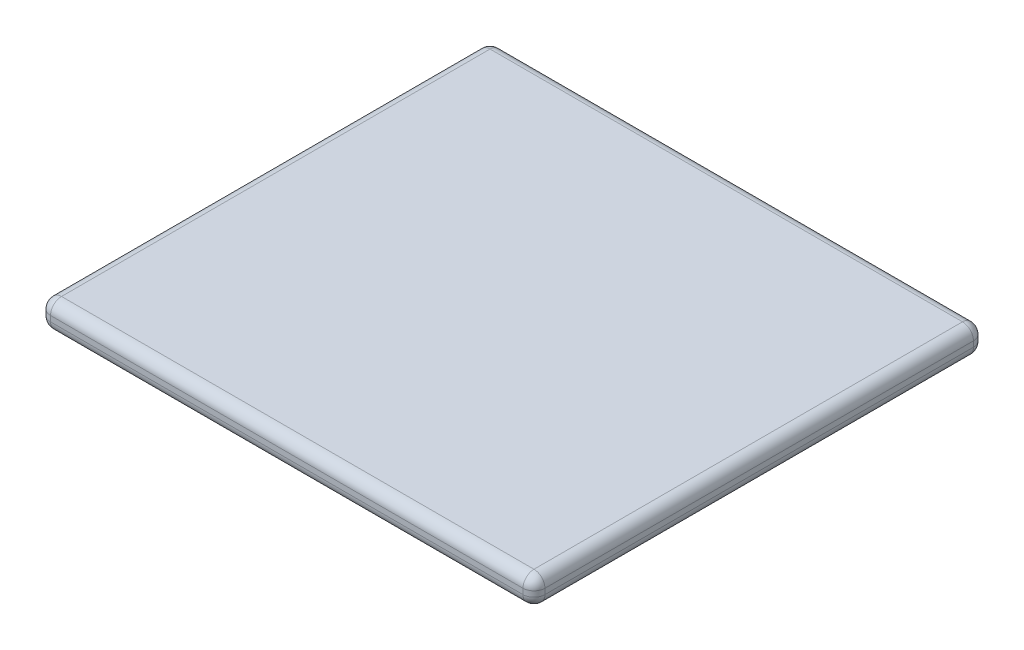
ISO-10303-21;
HEADER;
FILE_DESCRIPTION(('STEP AP214'),'2;1');
FILE_NAME('part.step','',(''),(''),'','','');
FILE_SCHEMA(('AUTOMOTIVE_DESIGN { 1 0 10303 214 1 1 1 1 }'));
ENDSEC;
DATA;
#1=APPLICATION_CONTEXT('core data for automotive mechanical design processes');
#2=APPLICATION_PROTOCOL_DEFINITION('international standard','automotive_design',2000,#1);
#3=PRODUCT_CONTEXT('',#1,'mechanical');
#4=PRODUCT('Part','Part','',(#3));
#5=PRODUCT_RELATED_PRODUCT_CATEGORY('part','',(#4));
#6=PRODUCT_DEFINITION_FORMATION('','',#4);
#7=PRODUCT_DEFINITION_CONTEXT('part definition',#1,'design');
#8=PRODUCT_DEFINITION('design','',#6,#7);
#9=PRODUCT_DEFINITION_SHAPE('','',#8);
#10=(LENGTH_UNIT() NAMED_UNIT(*) SI_UNIT(.MILLI.,.METRE.));
#11=(NAMED_UNIT(*) PLANE_ANGLE_UNIT() SI_UNIT($,.RADIAN.));
#12=(NAMED_UNIT(*) SI_UNIT($,.STERADIAN.) SOLID_ANGLE_UNIT());
#13=UNCERTAINTY_MEASURE_WITH_UNIT(LENGTH_MEASURE(1.E-05),#10,'distance_accuracy_value','');
#14=(GEOMETRIC_REPRESENTATION_CONTEXT(3) GLOBAL_UNCERTAINTY_ASSIGNED_CONTEXT((#13)) GLOBAL_UNIT_ASSIGNED_CONTEXT((#10,
#11,#12)) REPRESENTATION_CONTEXT('',''));
#15=CARTESIAN_POINT('',(0.,0.,0.));
#16=DIRECTION('',(0.,0.,1.));
#17=DIRECTION('',(1.,0.,0.));
#18=AXIS2_PLACEMENT_3D('',#15,#16,#17);
#19=CARTESIAN_POINT('',(245.,25.,205.));
#20=DIRECTION('',(-1.,0.,0.));
#21=DIRECTION('',(0.,0.,1.));
#22=AXIS2_PLACEMENT_3D('',#19,#20,#21);
#23=PLANE('',#22);
#24=DIRECTION('',(0.,-1.,0.));
#25=VECTOR('',#24,1.);
#26=CARTESIAN_POINT('',(245.,25.,-195.));
#27=LINE('',#26,#25);
#28=CARTESIAN_POINT('',(245.,10.,-195.));
#29=VERTEX_POINT('',#28);
#30=CARTESIAN_POINT('',(245.,15.,-195.));
#31=VERTEX_POINT('',#30);
#32=EDGE_CURVE('E142',#29,#31,#27,.F.);
#33=ORIENTED_EDGE('',*,*,#32,.T.);
#34=DIRECTION('',(0.,0.,-1.));
#35=VECTOR('',#34,1.);
#36=CARTESIAN_POINT('',(245.,15.,205.));
#37=LINE('',#36,#35);
#38=CARTESIAN_POINT('',(245.,15.,195.));
#39=VERTEX_POINT('',#38);
#40=EDGE_CURVE('E188',#31,#39,#37,.F.);
#41=ORIENTED_EDGE('',*,*,#40,.T.);
#42=DIRECTION('',(0.,-1.,0.));
#43=VECTOR('',#42,1.);
#44=CARTESIAN_POINT('',(245.,25.,195.));
#45=LINE('',#44,#43);
#46=CARTESIAN_POINT('',(245.,10.,195.));
#47=VERTEX_POINT('',#46);
#48=EDGE_CURVE('E183',#39,#47,#45,.T.);
#49=ORIENTED_EDGE('',*,*,#48,.T.);
#50=DIRECTION('',(0.,0.,-1.));
#51=VECTOR('',#50,1.);
#52=CARTESIAN_POINT('',(245.,10.,-205.));
#53=LINE('',#52,#51);
#54=EDGE_CURVE('E177',#47,#29,#53,.T.);
#55=ORIENTED_EDGE('',*,*,#54,.T.);
#56=EDGE_LOOP('',(#33,#41,#49,#55));
#57=FACE_BOUND('',#56,.T.);
#58=ADVANCED_FACE('F45',(#57),#23,.F.);
#59=CARTESIAN_POINT('',(-205.,25.,-205.));
#60=DIRECTION('',(0.,0.,1.));
#61=DIRECTION('',(1.,0.,0.));
#62=AXIS2_PLACEMENT_3D('',#59,#60,#61);
#63=PLANE('',#62);
#64=DIRECTION('',(0.,-1.,0.));
#65=VECTOR('',#64,1.);
#66=CARTESIAN_POINT('',(-195.,25.,-205.));
#67=LINE('',#66,#65);
#68=CARTESIAN_POINT('',(-195.,10.,-205.));
#69=VERTEX_POINT('',#68);
#70=CARTESIAN_POINT('',(-195.,15.,-205.));
#71=VERTEX_POINT('',#70);
#72=EDGE_CURVE('E167',#69,#71,#67,.F.);
#73=ORIENTED_EDGE('',*,*,#72,.T.);
#74=DIRECTION('',(-1.,0.,0.));
#75=VECTOR('',#74,1.);
#76=CARTESIAN_POINT('',(-205.,15.,-205.));
#77=LINE('',#76,#75);
#78=CARTESIAN_POINT('',(235.,15.,-205.));
#79=VERTEX_POINT('',#78);
#80=EDGE_CURVE('E171',#71,#79,#77,.F.);
#81=ORIENTED_EDGE('',*,*,#80,.T.);
#82=DIRECTION('',(0.,-1.,0.));
#83=VECTOR('',#82,1.);
#84=CARTESIAN_POINT('',(235.,25.,-205.));
#85=LINE('',#84,#83);
#86=CARTESIAN_POINT('',(235.,10.,-205.));
#87=VERTEX_POINT('',#86);
#88=EDGE_CURVE('E140',#79,#87,#85,.T.);
#89=ORIENTED_EDGE('',*,*,#88,.T.);
#90=DIRECTION('',(-1.,0.,0.));
#91=VECTOR('',#90,1.);
#92=CARTESIAN_POINT('',(-205.,10.,-205.));
#93=LINE('',#92,#91);
#94=EDGE_CURVE('E160',#87,#69,#93,.T.);
#95=ORIENTED_EDGE('',*,*,#94,.T.);
#96=EDGE_LOOP('',(#73,#81,#89,#95));
#97=FACE_BOUND('',#96,.T.);
#98=ADVANCED_FACE('F169',(#97),#63,.F.);
#99=CARTESIAN_POINT('',(-205.,25.,-205.));
#100=DIRECTION('',(1.,0.,0.));
#101=DIRECTION('',(0.,0.,-1.));
#102=AXIS2_PLACEMENT_3D('',#99,#100,#101);
#103=PLANE('',#102);
#104=DIRECTION('',(0.,-1.,0.));
#105=VECTOR('',#104,1.);
#106=CARTESIAN_POINT('',(-205.,25.,195.));
#107=LINE('',#106,#105);
#108=CARTESIAN_POINT('',(-205.,10.,195.));
#109=VERTEX_POINT('',#108);
#110=CARTESIAN_POINT('',(-205.,15.,195.));
#111=VERTEX_POINT('',#110);
#112=EDGE_CURVE('E194',#109,#111,#107,.F.);
#113=ORIENTED_EDGE('',*,*,#112,.T.);
#114=DIRECTION('',(0.,0.,1.));
#115=VECTOR('',#114,1.);
#116=CARTESIAN_POINT('',(-205.,15.,-205.));
#117=LINE('',#116,#115);
#118=CARTESIAN_POINT('',(-205.,15.,-195.));
#119=VERTEX_POINT('',#118);
#120=EDGE_CURVE('E201',#111,#119,#117,.F.);
#121=ORIENTED_EDGE('',*,*,#120,.T.);
#122=DIRECTION('',(0.,-1.,0.));
#123=VECTOR('',#122,1.);
#124=CARTESIAN_POINT('',(-205.,25.,-195.));
#125=LINE('',#124,#123);
#126=CARTESIAN_POINT('',(-205.,10.,-195.));
#127=VERTEX_POINT('',#126);
#128=EDGE_CURVE('E197',#119,#127,#125,.T.);
#129=ORIENTED_EDGE('',*,*,#128,.T.);
#130=DIRECTION('',(0.,0.,1.));
#131=VECTOR('',#130,1.);
#132=CARTESIAN_POINT('',(-205.,10.,205.));
#133=LINE('',#132,#131);
#134=EDGE_CURVE('E191',#127,#109,#133,.T.);
#135=ORIENTED_EDGE('',*,*,#134,.T.);
#136=EDGE_LOOP('',(#113,#121,#129,#135));
#137=FACE_BOUND('',#136,.T.);
#138=ADVANCED_FACE('F340',(#137),#103,.F.);
#139=CARTESIAN_POINT('',(-205.,25.,205.));
#140=DIRECTION('',(0.,0.,-1.));
#141=DIRECTION('',(-1.,0.,0.));
#142=AXIS2_PLACEMENT_3D('',#139,#140,#141);
#143=PLANE('',#142);
#144=DIRECTION('',(0.,-1.,0.));
#145=VECTOR('',#144,1.);
#146=CARTESIAN_POINT('',(235.,25.,205.));
#147=LINE('',#146,#145);
#148=CARTESIAN_POINT('',(235.,10.,205.));
#149=VERTEX_POINT('',#148);
#150=CARTESIAN_POINT('',(235.,15.,205.));
#151=VERTEX_POINT('',#150);
#152=EDGE_CURVE('E207',#149,#151,#147,.F.);
#153=ORIENTED_EDGE('',*,*,#152,.T.);
#154=DIRECTION('',(1.,0.,0.));
#155=VECTOR('',#154,1.);
#156=CARTESIAN_POINT('',(-205.,15.,205.));
#157=LINE('',#156,#155);
#158=CARTESIAN_POINT('',(-195.,15.,205.));
#159=VERTEX_POINT('',#158);
#160=EDGE_CURVE('E214',#151,#159,#157,.F.);
#161=ORIENTED_EDGE('',*,*,#160,.T.);
#162=DIRECTION('',(0.,-1.,0.));
#163=VECTOR('',#162,1.);
#164=CARTESIAN_POINT('',(-195.,25.,205.));
#165=LINE('',#164,#163);
#166=CARTESIAN_POINT('',(-195.,10.,205.));
#167=VERTEX_POINT('',#166);
#168=EDGE_CURVE('E210',#159,#167,#165,.T.);
#169=ORIENTED_EDGE('',*,*,#168,.T.);
#170=DIRECTION('',(1.,0.,0.));
#171=VECTOR('',#170,1.);
#172=CARTESIAN_POINT('',(245.,10.,205.));
#173=LINE('',#172,#171);
#174=EDGE_CURVE('E204',#167,#149,#173,.T.);
#175=ORIENTED_EDGE('',*,*,#174,.T.);
#176=EDGE_LOOP('',(#153,#161,#169,#175));
#177=FACE_BOUND('',#176,.T.);
#178=ADVANCED_FACE('F351',(#177),#143,.F.);
#179=CARTESIAN_POINT('',(0.,25.,0.));
#180=DIRECTION('',(0.,-1.,0.));
#181=DIRECTION('',(0.,0.,-1.));
#182=AXIS2_PLACEMENT_3D('',#179,#180,#181);
#183=PLANE('',#182);
#184=DIRECTION('',(0.,0.,1.));
#185=VECTOR('',#184,1.);
#186=CARTESIAN_POINT('',(-195.,25.,0.));
#187=LINE('',#186,#185);
#188=CARTESIAN_POINT('',(-195.,25.,-195.));
#189=VERTEX_POINT('',#188);
#190=CARTESIAN_POINT('',(-195.,25.,195.));
#191=VERTEX_POINT('',#190);
#192=EDGE_CURVE('E223',#189,#191,#187,.T.);
#193=ORIENTED_EDGE('',*,*,#192,.T.);
#194=DIRECTION('',(1.,0.,0.));
#195=VECTOR('',#194,1.);
#196=CARTESIAN_POINT('',(0.,25.,195.));
#197=LINE('',#196,#195);
#198=CARTESIAN_POINT('',(235.,25.,195.));
#199=VERTEX_POINT('',#198);
#200=EDGE_CURVE('E226',#191,#199,#197,.T.);
#201=ORIENTED_EDGE('',*,*,#200,.T.);
#202=DIRECTION('',(0.,0.,-1.));
#203=VECTOR('',#202,1.);
#204=CARTESIAN_POINT('',(235.,25.,0.));
#205=LINE('',#204,#203);
#206=CARTESIAN_POINT('',(235.,25.,-195.));
#207=VERTEX_POINT('',#206);
#208=EDGE_CURVE('E217',#199,#207,#205,.T.);
#209=ORIENTED_EDGE('',*,*,#208,.T.);
#210=DIRECTION('',(-1.,0.,0.));
#211=VECTOR('',#210,1.);
#212=CARTESIAN_POINT('',(0.,25.,-195.));
#213=LINE('',#212,#211);
#214=EDGE_CURVE('E220',#207,#189,#213,.T.);
#215=ORIENTED_EDGE('',*,*,#214,.T.);
#216=EDGE_LOOP('',(#193,#201,#209,#215));
#217=FACE_BOUND('',#216,.T.);
#218=ADVANCED_FACE('F332',(#217),#183,.F.);
#219=CARTESIAN_POINT('',(0.,0.,0.));
#220=DIRECTION('',(0.,-1.,0.));
#221=DIRECTION('',(0.,0.,-1.));
#222=AXIS2_PLACEMENT_3D('',#219,#220,#221);
#223=PLANE('',#222);
#224=DIRECTION('',(0.,0.,1.));
#225=VECTOR('',#224,1.);
#226=CARTESIAN_POINT('',(-195.,0.,-205.));
#227=LINE('',#226,#225);
#228=CARTESIAN_POINT('',(-195.,0.,195.));
#229=VERTEX_POINT('',#228);
#230=CARTESIAN_POINT('',(-195.,0.,-195.));
#231=VERTEX_POINT('',#230);
#232=EDGE_CURVE('E55',#229,#231,#227,.F.);
#233=ORIENTED_EDGE('',*,*,#232,.T.);
#234=DIRECTION('',(-1.,0.,0.));
#235=VECTOR('',#234,1.);
#236=CARTESIAN_POINT('',(245.,0.,-195.));
#237=LINE('',#236,#235);
#238=CARTESIAN_POINT('',(235.,0.,-195.));
#239=VERTEX_POINT('',#238);
#240=EDGE_CURVE('E11',#231,#239,#237,.F.);
#241=ORIENTED_EDGE('',*,*,#240,.T.);
#242=DIRECTION('',(0.,0.,-1.));
#243=VECTOR('',#242,1.);
#244=CARTESIAN_POINT('',(235.,0.,205.));
#245=LINE('',#244,#243);
#246=CARTESIAN_POINT('',(235.,0.,195.));
#247=VERTEX_POINT('',#246);
#248=EDGE_CURVE('E230',#239,#247,#245,.F.);
#249=ORIENTED_EDGE('',*,*,#248,.T.);
#250=DIRECTION('',(1.,0.,0.));
#251=VECTOR('',#250,1.);
#252=CARTESIAN_POINT('',(-205.,0.,195.));
#253=LINE('',#252,#251);
#254=EDGE_CURVE('E66',#247,#229,#253,.F.);
#255=ORIENTED_EDGE('',*,*,#254,.T.);
#256=EDGE_LOOP('',(#233,#241,#249,#255));
#257=FACE_BOUND('',#256,.T.);
#258=ADVANCED_FACE('F577',(#257),#223,.T.);
#259=CARTESIAN_POINT('',(-195.,25.,195.));
#260=DIRECTION('',(0.,-1.,0.));
#261=DIRECTION('',(0.,0.,-1.));
#262=AXIS2_PLACEMENT_3D('',#259,#260,#261);
#263=CYLINDRICAL_SURFACE('',#262,10.);
#264=CARTESIAN_POINT('',(-195.,15.,195.));
#265=DIRECTION('',(0.,1.,0.));
#266=DIRECTION('',(0.,0.,1.));
#267=AXIS2_PLACEMENT_3D('',#264,#265,#266);
#268=CIRCLE('',#267,10.);
#269=EDGE_CURVE('E49',#111,#159,#268,.T.);
#270=ORIENTED_EDGE('',*,*,#269,.F.);
#271=ORIENTED_EDGE('',*,*,#112,.F.);
#272=CARTESIAN_POINT('',(-195.,10.,195.));
#273=DIRECTION('',(0.,-1.,0.));
#274=DIRECTION('',(0.,0.,-1.));
#275=AXIS2_PLACEMENT_3D('',#272,#273,#274);
#276=CIRCLE('',#275,10.);
#277=EDGE_CURVE('E307',#167,#109,#276,.T.);
#278=ORIENTED_EDGE('',*,*,#277,.F.);
#279=ORIENTED_EDGE('',*,*,#168,.F.);
#280=EDGE_LOOP('',(#270,#271,#278,#279));
#281=FACE_BOUND('',#280,.T.);
#282=ADVANCED_FACE('F47',(#281),#263,.T.);
#283=CARTESIAN_POINT('',(-195.,15.,195.));
#284=DIRECTION('',(0.,0.,1.));
#285=DIRECTION('',(1.,0.,0.));
#286=AXIS2_PLACEMENT_3D('',#283,#284,#285);
#287=SPHERICAL_SURFACE('',#286,10.);
#288=CARTESIAN_POINT('',(-195.,15.,195.));
#289=DIRECTION('',(0.,0.,1.));
#290=DIRECTION('',(1.,0.,0.));
#291=AXIS2_PLACEMENT_3D('',#288,#289,#290);
#292=CIRCLE('',#291,10.);
#293=EDGE_CURVE('E300',#111,#191,#292,.F.);
#294=ORIENTED_EDGE('',*,*,#293,.F.);
#295=ORIENTED_EDGE('',*,*,#269,.T.);
#296=CARTESIAN_POINT('',(-195.,15.,195.));
#297=DIRECTION('',(-1.,0.,0.));
#298=DIRECTION('',(0.,0.,1.));
#299=AXIS2_PLACEMENT_3D('',#296,#297,#298);
#300=CIRCLE('',#299,10.);
#301=EDGE_CURVE('E304',#191,#159,#300,.F.);
#302=ORIENTED_EDGE('',*,*,#301,.F.);
#303=EDGE_LOOP('',(#294,#295,#302));
#304=FACE_BOUND('',#303,.T.);
#305=ADVANCED_FACE('F320',(#304),#287,.T.);
#306=CARTESIAN_POINT('',(-195.,10.,195.));
#307=DIRECTION('',(-1.,0.,0.));
#308=DIRECTION('',(0.,0.,1.));
#309=AXIS2_PLACEMENT_3D('',#306,#307,#308);
#310=SPHERICAL_SURFACE('',#309,10.);
#311=CARTESIAN_POINT('',(-195.,10.,195.));
#312=DIRECTION('',(-1.,0.,0.));
#313=DIRECTION('',(0.,0.,1.));
#314=AXIS2_PLACEMENT_3D('',#311,#312,#313);
#315=CIRCLE('',#314,10.);
#316=EDGE_CURVE('E293',#167,#229,#315,.F.);
#317=ORIENTED_EDGE('',*,*,#316,.F.);
#318=ORIENTED_EDGE('',*,*,#277,.T.);
#319=CARTESIAN_POINT('',(-195.,10.,195.));
#320=DIRECTION('',(0.,0.,1.));
#321=DIRECTION('',(1.,0.,0.));
#322=AXIS2_PLACEMENT_3D('',#319,#320,#321);
#323=CIRCLE('',#322,10.);
#324=EDGE_CURVE('E296',#229,#109,#323,.F.);
#325=ORIENTED_EDGE('',*,*,#324,.F.);
#326=EDGE_LOOP('',(#317,#318,#325));
#327=FACE_BOUND('',#326,.T.);
#328=ADVANCED_FACE('F550',(#327),#310,.T.);
#329=CARTESIAN_POINT('',(0.,15.,195.));
#330=DIRECTION('',(1.,0.,0.));
#331=DIRECTION('',(0.,0.,-1.));
#332=AXIS2_PLACEMENT_3D('',#329,#330,#331);
#333=CYLINDRICAL_SURFACE('',#332,10.);
#334=ORIENTED_EDGE('',*,*,#301,.T.);
#335=ORIENTED_EDGE('',*,*,#160,.F.);
#336=CARTESIAN_POINT('',(235.,15.,195.));
#337=DIRECTION('',(1.,0.,0.));
#338=DIRECTION('',(0.,0.,-1.));
#339=AXIS2_PLACEMENT_3D('',#336,#337,#338);
#340=CIRCLE('',#339,10.);
#341=EDGE_CURVE('E285',#199,#151,#340,.T.);
#342=ORIENTED_EDGE('',*,*,#341,.F.);
#343=ORIENTED_EDGE('',*,*,#200,.F.);
#344=EDGE_LOOP('',(#334,#335,#342,#343));
#345=FACE_BOUND('',#344,.T.);
#346=ADVANCED_FACE('F328',(#345),#333,.T.);
#347=CARTESIAN_POINT('',(-195.,15.,0.));
#348=DIRECTION('',(0.,0.,1.));
#349=DIRECTION('',(1.,0.,0.));
#350=AXIS2_PLACEMENT_3D('',#347,#348,#349);
#351=CYLINDRICAL_SURFACE('',#350,10.);
#352=ORIENTED_EDGE('',*,*,#293,.T.);
#353=ORIENTED_EDGE('',*,*,#192,.F.);
#354=CARTESIAN_POINT('',(-195.,15.,-195.));
#355=DIRECTION('',(0.,0.,-1.));
#356=DIRECTION('',(-1.,0.,0.));
#357=AXIS2_PLACEMENT_3D('',#354,#355,#356);
#358=CIRCLE('',#357,10.);
#359=EDGE_CURVE('E281',#119,#189,#358,.T.);
#360=ORIENTED_EDGE('',*,*,#359,.F.);
#361=ORIENTED_EDGE('',*,*,#120,.F.);
#362=EDGE_LOOP('',(#352,#353,#360,#361));
#363=FACE_BOUND('',#362,.T.);
#364=ADVANCED_FACE('F337',(#363),#351,.T.);
#365=CARTESIAN_POINT('',(-195.,25.,-195.));
#366=DIRECTION('',(0.,-1.,0.));
#367=DIRECTION('',(0.,0.,-1.));
#368=AXIS2_PLACEMENT_3D('',#365,#366,#367);
#369=CYLINDRICAL_SURFACE('',#368,10.);
#370=CARTESIAN_POINT('',(-195.,10.,-195.));
#371=DIRECTION('',(0.,-1.,0.));
#372=DIRECTION('',(0.,0.,-1.));
#373=AXIS2_PLACEMENT_3D('',#370,#371,#372);
#374=CIRCLE('',#373,10.);
#375=EDGE_CURVE('E273',#127,#69,#374,.T.);
#376=ORIENTED_EDGE('',*,*,#375,.F.);
#377=ORIENTED_EDGE('',*,*,#128,.F.);
#378=CARTESIAN_POINT('',(-195.,15.,-195.));
#379=DIRECTION('',(0.,1.,0.));
#380=DIRECTION('',(0.,0.,1.));
#381=AXIS2_PLACEMENT_3D('',#378,#379,#380);
#382=CIRCLE('',#381,10.);
#383=EDGE_CURVE('E277',#71,#119,#382,.T.);
#384=ORIENTED_EDGE('',*,*,#383,.F.);
#385=ORIENTED_EDGE('',*,*,#72,.F.);
#386=EDGE_LOOP('',(#376,#377,#384,#385));
#387=FACE_BOUND('',#386,.T.);
#388=ADVANCED_FACE('F344',(#387),#369,.T.);
#389=CARTESIAN_POINT('',(-195.,10.,-205.));
#390=DIRECTION('',(0.,0.,-1.));
#391=DIRECTION('',(-1.,0.,0.));
#392=AXIS2_PLACEMENT_3D('',#389,#390,#391);
#393=CYLINDRICAL_SURFACE('',#392,10.);
#394=ORIENTED_EDGE('',*,*,#324,.T.);
#395=ORIENTED_EDGE('',*,*,#134,.F.);
#396=CARTESIAN_POINT('',(-195.,10.,-195.));
#397=DIRECTION('',(0.,0.,-1.));
#398=DIRECTION('',(-1.,0.,0.));
#399=AXIS2_PLACEMENT_3D('',#396,#397,#398);
#400=CIRCLE('',#399,10.);
#401=EDGE_CURVE('E270',#231,#127,#400,.T.);
#402=ORIENTED_EDGE('',*,*,#401,.F.);
#403=ORIENTED_EDGE('',*,*,#232,.F.);
#404=EDGE_LOOP('',(#394,#395,#402,#403));
#405=FACE_BOUND('',#404,.T.);
#406=ADVANCED_FACE('F349',(#405),#393,.T.);
#407=CARTESIAN_POINT('',(-205.,10.,195.));
#408=DIRECTION('',(-1.,0.,0.));
#409=DIRECTION('',(0.,0.,1.));
#410=AXIS2_PLACEMENT_3D('',#407,#408,#409);
#411=CYLINDRICAL_SURFACE('',#410,10.);
#412=ORIENTED_EDGE('',*,*,#316,.T.);
#413=ORIENTED_EDGE('',*,*,#254,.F.);
#414=CARTESIAN_POINT('',(235.,10.,195.));
#415=DIRECTION('',(1.,0.,0.));
#416=DIRECTION('',(0.,0.,-1.));
#417=AXIS2_PLACEMENT_3D('',#414,#415,#416);
#418=CIRCLE('',#417,10.);
#419=EDGE_CURVE('E266',#149,#247,#418,.T.);
#420=ORIENTED_EDGE('',*,*,#419,.F.);
#421=ORIENTED_EDGE('',*,*,#174,.F.);
#422=EDGE_LOOP('',(#412,#413,#420,#421));
#423=FACE_BOUND('',#422,.T.);
#424=ADVANCED_FACE('F360',(#423),#411,.T.);
#425=CARTESIAN_POINT('',(235.,25.,195.));
#426=DIRECTION('',(0.,-1.,0.));
#427=DIRECTION('',(0.,0.,-1.));
#428=AXIS2_PLACEMENT_3D('',#425,#426,#427);
#429=CYLINDRICAL_SURFACE('',#428,10.);
#430=CARTESIAN_POINT('',(235.,15.,195.));
#431=DIRECTION('',(0.,1.,0.));
#432=DIRECTION('',(0.,0.,1.));
#433=AXIS2_PLACEMENT_3D('',#430,#431,#432);
#434=CIRCLE('',#433,10.);
#435=EDGE_CURVE('E289',#151,#39,#434,.T.);
#436=ORIENTED_EDGE('',*,*,#435,.F.);
#437=ORIENTED_EDGE('',*,*,#152,.F.);
#438=CARTESIAN_POINT('',(235.,10.,195.));
#439=DIRECTION('',(0.,-1.,0.));
#440=DIRECTION('',(0.,0.,-1.));
#441=AXIS2_PLACEMENT_3D('',#438,#439,#440);
#442=CIRCLE('',#441,10.);
#443=EDGE_CURVE('E262',#47,#149,#442,.T.);
#444=ORIENTED_EDGE('',*,*,#443,.F.);
#445=ORIENTED_EDGE('',*,*,#48,.F.);
#446=EDGE_LOOP('',(#436,#437,#444,#445));
#447=FACE_BOUND('',#446,.T.);
#448=ADVANCED_FACE('F356',(#447),#429,.T.);
#449=CARTESIAN_POINT('',(235.,15.,195.));
#450=DIRECTION('',(0.,0.,1.));
#451=DIRECTION('',(1.,0.,0.));
#452=AXIS2_PLACEMENT_3D('',#449,#450,#451);
#453=SPHERICAL_SURFACE('',#452,10.);
#454=ORIENTED_EDGE('',*,*,#341,.T.);
#455=ORIENTED_EDGE('',*,*,#435,.T.);
#456=CARTESIAN_POINT('',(235.,15.,195.));
#457=DIRECTION('',(0.,0.,1.));
#458=DIRECTION('',(1.,0.,0.));
#459=AXIS2_PLACEMENT_3D('',#456,#457,#458);
#460=CIRCLE('',#459,10.);
#461=EDGE_CURVE('E258',#199,#39,#460,.F.);
#462=ORIENTED_EDGE('',*,*,#461,.F.);
#463=EDGE_LOOP('',(#454,#455,#462));
#464=FACE_BOUND('',#463,.T.);
#465=ADVANCED_FACE('F370',(#464),#453,.T.);
#466=CARTESIAN_POINT('',(-195.,15.,-195.));
#467=DIRECTION('',(-1.,0.,0.));
#468=DIRECTION('',(0.,0.,1.));
#469=AXIS2_PLACEMENT_3D('',#466,#467,#468);
#470=SPHERICAL_SURFACE('',#469,10.);
#471=ORIENTED_EDGE('',*,*,#383,.T.);
#472=ORIENTED_EDGE('',*,*,#359,.T.);
#473=CARTESIAN_POINT('',(-195.,15.,-195.));
#474=DIRECTION('',(-1.,0.,0.));
#475=DIRECTION('',(0.,0.,1.));
#476=AXIS2_PLACEMENT_3D('',#473,#474,#475);
#477=CIRCLE('',#476,10.);
#478=EDGE_CURVE('E254',#71,#189,#477,.F.);
#479=ORIENTED_EDGE('',*,*,#478,.F.);
#480=EDGE_LOOP('',(#471,#472,#479));
#481=FACE_BOUND('',#480,.T.);
#482=ADVANCED_FACE('F380',(#481),#470,.T.);
#483=CARTESIAN_POINT('',(-195.,10.,-195.));
#484=DIRECTION('',(-1.,0.,0.));
#485=DIRECTION('',(0.,0.,1.));
#486=AXIS2_PLACEMENT_3D('',#483,#484,#485);
#487=SPHERICAL_SURFACE('',#486,10.);
#488=ORIENTED_EDGE('',*,*,#401,.T.);
#489=ORIENTED_EDGE('',*,*,#375,.T.);
#490=CARTESIAN_POINT('',(-195.,10.,-195.));
#491=DIRECTION('',(-1.,0.,0.));
#492=DIRECTION('',(0.,0.,1.));
#493=AXIS2_PLACEMENT_3D('',#490,#491,#492);
#494=CIRCLE('',#493,10.);
#495=EDGE_CURVE('E163',#231,#69,#494,.F.);
#496=ORIENTED_EDGE('',*,*,#495,.F.);
#497=EDGE_LOOP('',(#488,#489,#496));
#498=FACE_BOUND('',#497,.T.);
#499=ADVANCED_FACE('F382',(#498),#487,.T.);
#500=CARTESIAN_POINT('',(235.,10.,195.));
#501=DIRECTION('',(0.,0.,1.));
#502=DIRECTION('',(1.,0.,0.));
#503=AXIS2_PLACEMENT_3D('',#500,#501,#502);
#504=SPHERICAL_SURFACE('',#503,10.);
#505=ORIENTED_EDGE('',*,*,#443,.T.);
#506=ORIENTED_EDGE('',*,*,#419,.T.);
#507=CARTESIAN_POINT('',(235.,10.,195.));
#508=DIRECTION('',(0.,0.,1.));
#509=DIRECTION('',(1.,0.,0.));
#510=AXIS2_PLACEMENT_3D('',#507,#508,#509);
#511=CIRCLE('',#510,10.);
#512=EDGE_CURVE('E248',#47,#247,#511,.F.);
#513=ORIENTED_EDGE('',*,*,#512,.F.);
#514=EDGE_LOOP('',(#505,#506,#513));
#515=FACE_BOUND('',#514,.T.);
#516=ADVANCED_FACE('F362',(#515),#504,.T.);
#517=CARTESIAN_POINT('',(235.,15.,0.));
#518=DIRECTION('',(0.,0.,-1.));
#519=DIRECTION('',(-1.,0.,0.));
#520=AXIS2_PLACEMENT_3D('',#517,#518,#519);
#521=CYLINDRICAL_SURFACE('',#520,10.);
#522=ORIENTED_EDGE('',*,*,#461,.T.);
#523=ORIENTED_EDGE('',*,*,#40,.F.);
#524=CARTESIAN_POINT('',(235.,15.,-195.));
#525=DIRECTION('',(0.,0.,-1.));
#526=DIRECTION('',(-1.,0.,0.));
#527=AXIS2_PLACEMENT_3D('',#524,#525,#526);
#528=CIRCLE('',#527,10.);
#529=EDGE_CURVE('E244',#207,#31,#528,.T.);
#530=ORIENTED_EDGE('',*,*,#529,.F.);
#531=ORIENTED_EDGE('',*,*,#208,.F.);
#532=EDGE_LOOP('',(#522,#523,#530,#531));
#533=FACE_BOUND('',#532,.T.);
#534=ADVANCED_FACE('F372',(#533),#521,.T.);
#535=CARTESIAN_POINT('',(0.,15.,-195.));
#536=DIRECTION('',(-1.,0.,0.));
#537=DIRECTION('',(0.,0.,1.));
#538=AXIS2_PLACEMENT_3D('',#535,#536,#537);
#539=CYLINDRICAL_SURFACE('',#538,10.);
#540=ORIENTED_EDGE('',*,*,#478,.T.);
#541=ORIENTED_EDGE('',*,*,#214,.F.);
#542=CARTESIAN_POINT('',(235.,15.,-195.));
#543=DIRECTION('',(1.,0.,0.));
#544=DIRECTION('',(0.,0.,-1.));
#545=AXIS2_PLACEMENT_3D('',#542,#543,#544);
#546=CIRCLE('',#545,10.);
#547=EDGE_CURVE('E157',#79,#207,#546,.T.);
#548=ORIENTED_EDGE('',*,*,#547,.F.);
#549=ORIENTED_EDGE('',*,*,#80,.F.);
#550=EDGE_LOOP('',(#540,#541,#548,#549));
#551=FACE_BOUND('',#550,.T.);
#552=ADVANCED_FACE('F378',(#551),#539,.T.);
#553=CARTESIAN_POINT('',(-205.,10.,-195.));
#554=DIRECTION('',(1.,0.,0.));
#555=DIRECTION('',(0.,0.,-1.));
#556=AXIS2_PLACEMENT_3D('',#553,#554,#555);
#557=CYLINDRICAL_SURFACE('',#556,10.);
#558=ORIENTED_EDGE('',*,*,#495,.T.);
#559=ORIENTED_EDGE('',*,*,#94,.F.);
#560=CARTESIAN_POINT('',(235.,10.,-195.));
#561=DIRECTION('',(1.,0.,0.));
#562=DIRECTION('',(0.,0.,-1.));
#563=AXIS2_PLACEMENT_3D('',#560,#561,#562);
#564=CIRCLE('',#563,10.);
#565=EDGE_CURVE('E148',#239,#87,#564,.T.);
#566=ORIENTED_EDGE('',*,*,#565,.F.);
#567=ORIENTED_EDGE('',*,*,#240,.F.);
#568=EDGE_LOOP('',(#558,#559,#566,#567));
#569=FACE_BOUND('',#568,.T.);
#570=ADVANCED_FACE('F161',(#569),#557,.T.);
#571=CARTESIAN_POINT('',(235.,10.,205.));
#572=DIRECTION('',(0.,0.,1.));
#573=DIRECTION('',(1.,0.,0.));
#574=AXIS2_PLACEMENT_3D('',#571,#572,#573);
#575=CYLINDRICAL_SURFACE('',#574,10.);
#576=ORIENTED_EDGE('',*,*,#512,.T.);
#577=ORIENTED_EDGE('',*,*,#248,.F.);
#578=CARTESIAN_POINT('',(235.,10.,-195.));
#579=DIRECTION('',(0.,0.,-1.));
#580=DIRECTION('',(-1.,0.,0.));
#581=AXIS2_PLACEMENT_3D('',#578,#579,#580);
#582=CIRCLE('',#581,10.);
#583=EDGE_CURVE('E152',#29,#239,#582,.T.);
#584=ORIENTED_EDGE('',*,*,#583,.F.);
#585=ORIENTED_EDGE('',*,*,#54,.F.);
#586=EDGE_LOOP('',(#576,#577,#584,#585));
#587=FACE_BOUND('',#586,.T.);
#588=ADVANCED_FACE('F365',(#587),#575,.T.);
#589=CARTESIAN_POINT('',(235.,15.,-195.));
#590=DIRECTION('',(0.,1.,0.));
#591=DIRECTION('',(0.,0.,1.));
#592=AXIS2_PLACEMENT_3D('',#589,#590,#591);
#593=SPHERICAL_SURFACE('',#592,10.);
#594=ORIENTED_EDGE('',*,*,#547,.T.);
#595=ORIENTED_EDGE('',*,*,#529,.T.);
#596=CARTESIAN_POINT('',(235.,15.,-195.));
#597=DIRECTION('',(0.,1.,0.));
#598=DIRECTION('',(0.,0.,1.));
#599=AXIS2_PLACEMENT_3D('',#596,#597,#598);
#600=CIRCLE('',#599,10.);
#601=EDGE_CURVE('E145',#79,#31,#600,.F.);
#602=ORIENTED_EDGE('',*,*,#601,.F.);
#603=EDGE_LOOP('',(#594,#595,#602));
#604=FACE_BOUND('',#603,.T.);
#605=ADVANCED_FACE('F376',(#604),#593,.T.);
#606=CARTESIAN_POINT('',(235.,10.,-195.));
#607=DIRECTION('',(0.,-1.,0.));
#608=DIRECTION('',(0.,0.,-1.));
#609=AXIS2_PLACEMENT_3D('',#606,#607,#608);
#610=SPHERICAL_SURFACE('',#609,10.);
#611=ORIENTED_EDGE('',*,*,#583,.T.);
#612=ORIENTED_EDGE('',*,*,#565,.T.);
#613=CARTESIAN_POINT('',(235.,10.,-195.));
#614=DIRECTION('',(0.,-1.,0.));
#615=DIRECTION('',(0.,0.,-1.));
#616=AXIS2_PLACEMENT_3D('',#613,#614,#615);
#617=CIRCLE('',#616,10.);
#618=EDGE_CURVE('E136',#29,#87,#617,.F.);
#619=ORIENTED_EDGE('',*,*,#618,.F.);
#620=EDGE_LOOP('',(#611,#612,#619));
#621=FACE_BOUND('',#620,.T.);
#622=ADVANCED_FACE('F150',(#621),#610,.T.);
#623=CARTESIAN_POINT('',(235.,25.,-195.));
#624=DIRECTION('',(0.,-1.,0.));
#625=DIRECTION('',(0.,0.,-1.));
#626=AXIS2_PLACEMENT_3D('',#623,#624,#625);
#627=CYLINDRICAL_SURFACE('',#626,10.);
#628=ORIENTED_EDGE('',*,*,#601,.T.);
#629=ORIENTED_EDGE('',*,*,#32,.F.);
#630=ORIENTED_EDGE('',*,*,#618,.T.);
#631=ORIENTED_EDGE('',*,*,#88,.F.);
#632=EDGE_LOOP('',(#628,#629,#630,#631));
#633=FACE_BOUND('',#632,.T.);
#634=ADVANCED_FACE('F138',(#633),#627,.T.);
#635=CLOSED_SHELL('',(#58,#98,#138,#178,#218,#258,#282,#305,#328,#346,#364,#388,#406,#424,#448,
#465,#482,#499,#516,#534,#552,#570,#588,#605,#622,#634));
#636=MANIFOLD_SOLID_BREP('B2',#635);
#637=ADVANCED_BREP_SHAPE_REPRESENTATION('',(#18,#636),#14);
#638=SHAPE_DEFINITION_REPRESENTATION(#9,#637);
ENDSEC;
END-ISO-10303-21;
